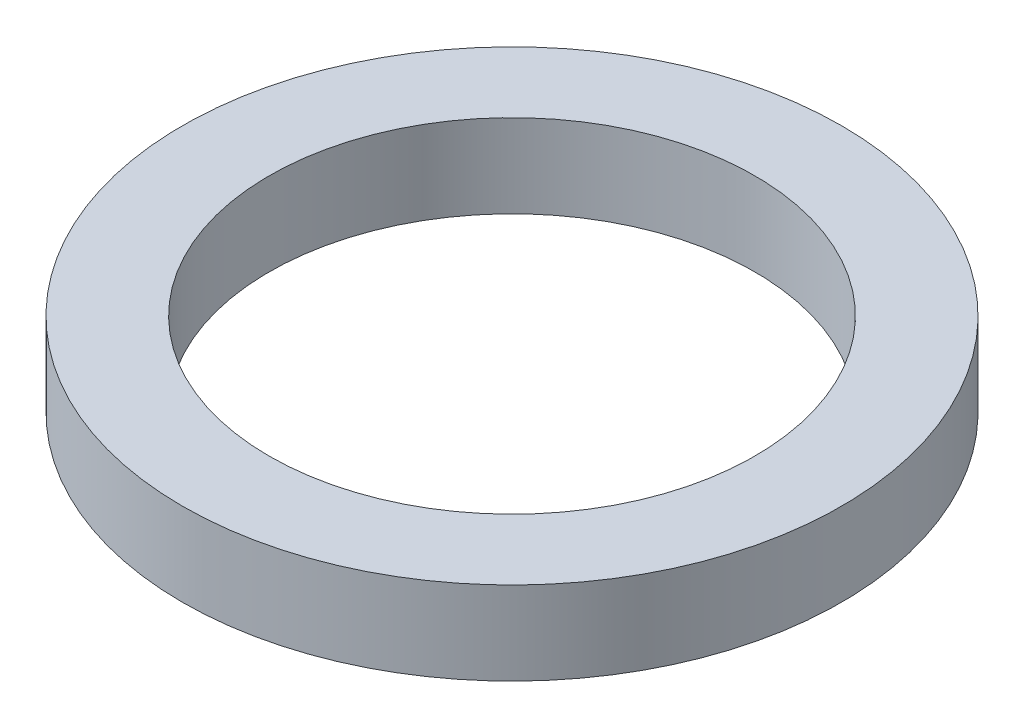
ISO-10303-21;
HEADER;
FILE_DESCRIPTION(('STEP AP214'),'2;1');
FILE_NAME('part.step','',(''),(''),'','','');
FILE_SCHEMA(('AUTOMOTIVE_DESIGN { 1 0 10303 214 1 1 1 1 }'));
ENDSEC;
DATA;
#1=APPLICATION_CONTEXT('core data for automotive mechanical design processes');
#2=APPLICATION_PROTOCOL_DEFINITION('international standard','automotive_design',2000,#1);
#3=PRODUCT_CONTEXT('',#1,'mechanical');
#4=PRODUCT('Part','Part','',(#3));
#5=PRODUCT_RELATED_PRODUCT_CATEGORY('part','',(#4));
#6=PRODUCT_DEFINITION_FORMATION('','',#4);
#7=PRODUCT_DEFINITION_CONTEXT('part definition',#1,'design');
#8=PRODUCT_DEFINITION('design','',#6,#7);
#9=PRODUCT_DEFINITION_SHAPE('','',#8);
#10=(LENGTH_UNIT() NAMED_UNIT(*) SI_UNIT(.MILLI.,.METRE.));
#11=(NAMED_UNIT(*) PLANE_ANGLE_UNIT() SI_UNIT($,.RADIAN.));
#12=(NAMED_UNIT(*) SI_UNIT($,.STERADIAN.) SOLID_ANGLE_UNIT());
#13=UNCERTAINTY_MEASURE_WITH_UNIT(LENGTH_MEASURE(1.E-05),#10,'distance_accuracy_value','');
#14=(GEOMETRIC_REPRESENTATION_CONTEXT(3) GLOBAL_UNCERTAINTY_ASSIGNED_CONTEXT((#13)) GLOBAL_UNIT_ASSIGNED_CONTEXT((#10,
#11,#12)) REPRESENTATION_CONTEXT('',''));
#15=CARTESIAN_POINT('',(0.,0.,0.));
#16=DIRECTION('',(0.,0.,1.));
#17=DIRECTION('',(1.,0.,0.));
#18=AXIS2_PLACEMENT_3D('',#15,#16,#17);
#19=CARTESIAN_POINT('',(0.,12.,0.));
#20=DIRECTION('',(0.,-1.,0.));
#21=DIRECTION('',(0.,0.,-1.));
#22=AXIS2_PLACEMENT_3D('',#19,#20,#21);
#23=CYLINDRICAL_SURFACE('',#22,47.5);
#24=CARTESIAN_POINT('',(0.,12.,0.));
#25=DIRECTION('',(0.,1.,0.));
#26=DIRECTION('',(0.,0.,1.));
#27=AXIS2_PLACEMENT_3D('',#24,#25,#26);
#28=CIRCLE('',#27,47.5);
#29=CARTESIAN_POINT('',(0.,12.,47.5));
#30=VERTEX_POINT('',#29);
#31=EDGE_CURVE('E10',#30,#30,#28,.T.);
#32=ORIENTED_EDGE('',*,*,#31,.F.);
#33=EDGE_LOOP('',(#32));
#34=FACE_BOUND('',#33,.T.);
#35=CARTESIAN_POINT('',(0.,0.,0.));
#36=DIRECTION('',(0.,1.,0.));
#37=DIRECTION('',(0.,0.,1.));
#38=AXIS2_PLACEMENT_3D('',#35,#36,#37);
#39=CIRCLE('',#38,47.5);
#40=CARTESIAN_POINT('',(0.,0.,47.5));
#41=VERTEX_POINT('',#40);
#42=EDGE_CURVE('E37',#41,#41,#39,.T.);
#43=ORIENTED_EDGE('',*,*,#42,.T.);
#44=EDGE_LOOP('',(#43));
#45=FACE_BOUND('',#44,.T.);
#46=ADVANCED_FACE('F40',(#34,#45),#23,.T.);
#47=CARTESIAN_POINT('',(0.,12.,0.));
#48=DIRECTION('',(0.,1.,0.));
#49=DIRECTION('',(0.,0.,1.));
#50=AXIS2_PLACEMENT_3D('',#47,#48,#49);
#51=PLANE('',#50);
#52=CARTESIAN_POINT('',(0.,12.,0.));
#53=DIRECTION('',(0.,1.,0.));
#54=DIRECTION('',(0.,0.,1.));
#55=AXIS2_PLACEMENT_3D('',#52,#53,#54);
#56=CIRCLE('',#55,35.);
#57=CARTESIAN_POINT('',(0.,12.,35.));
#58=VERTEX_POINT('',#57);
#59=EDGE_CURVE('E50',#58,#58,#56,.T.);
#60=ORIENTED_EDGE('',*,*,#59,.F.);
#61=EDGE_LOOP('',(#60));
#62=FACE_BOUND('',#61,.T.);
#63=ORIENTED_EDGE('',*,*,#31,.T.);
#64=EDGE_LOOP('',(#63));
#65=FACE_BOUND('',#64,.T.);
#66=ADVANCED_FACE('F59',(#62,#65),#51,.T.);
#67=CARTESIAN_POINT('',(0.,0.,0.));
#68=DIRECTION('',(0.,1.,0.));
#69=DIRECTION('',(0.,0.,1.));
#70=AXIS2_PLACEMENT_3D('',#67,#68,#69);
#71=PLANE('',#70);
#72=CARTESIAN_POINT('',(0.,0.,0.));
#73=DIRECTION('',(0.,1.,0.));
#74=DIRECTION('',(0.,0.,1.));
#75=AXIS2_PLACEMENT_3D('',#72,#73,#74);
#76=CIRCLE('',#75,35.);
#77=CARTESIAN_POINT('',(0.,0.,35.));
#78=VERTEX_POINT('',#77);
#79=EDGE_CURVE('E47',#78,#78,#76,.T.);
#80=ORIENTED_EDGE('',*,*,#79,.T.);
#81=EDGE_LOOP('',(#80));
#82=FACE_BOUND('',#81,.T.);
#83=ORIENTED_EDGE('',*,*,#42,.F.);
#84=EDGE_LOOP('',(#83));
#85=FACE_BOUND('',#84,.T.);
#86=ADVANCED_FACE('F58',(#82,#85),#71,.F.);
#87=CARTESIAN_POINT('',(0.,12.,0.));
#88=DIRECTION('',(0.,-1.,0.));
#89=DIRECTION('',(0.,0.,-1.));
#90=AXIS2_PLACEMENT_3D('',#87,#88,#89);
#91=CYLINDRICAL_SURFACE('',#90,35.);
#92=ORIENTED_EDGE('',*,*,#59,.T.);
#93=EDGE_LOOP('',(#92));
#94=FACE_BOUND('',#93,.T.);
#95=ORIENTED_EDGE('',*,*,#79,.F.);
#96=EDGE_LOOP('',(#95));
#97=FACE_BOUND('',#96,.T.);
#98=ADVANCED_FACE('F54',(#94,#97),#91,.F.);
#99=CLOSED_SHELL('',(#46,#66,#86,#98));
#100=MANIFOLD_SOLID_BREP('B2',#99);
#101=ADVANCED_BREP_SHAPE_REPRESENTATION('',(#18,#100),#14);
#102=SHAPE_DEFINITION_REPRESENTATION(#9,#101);
ENDSEC;
END-ISO-10303-21;
